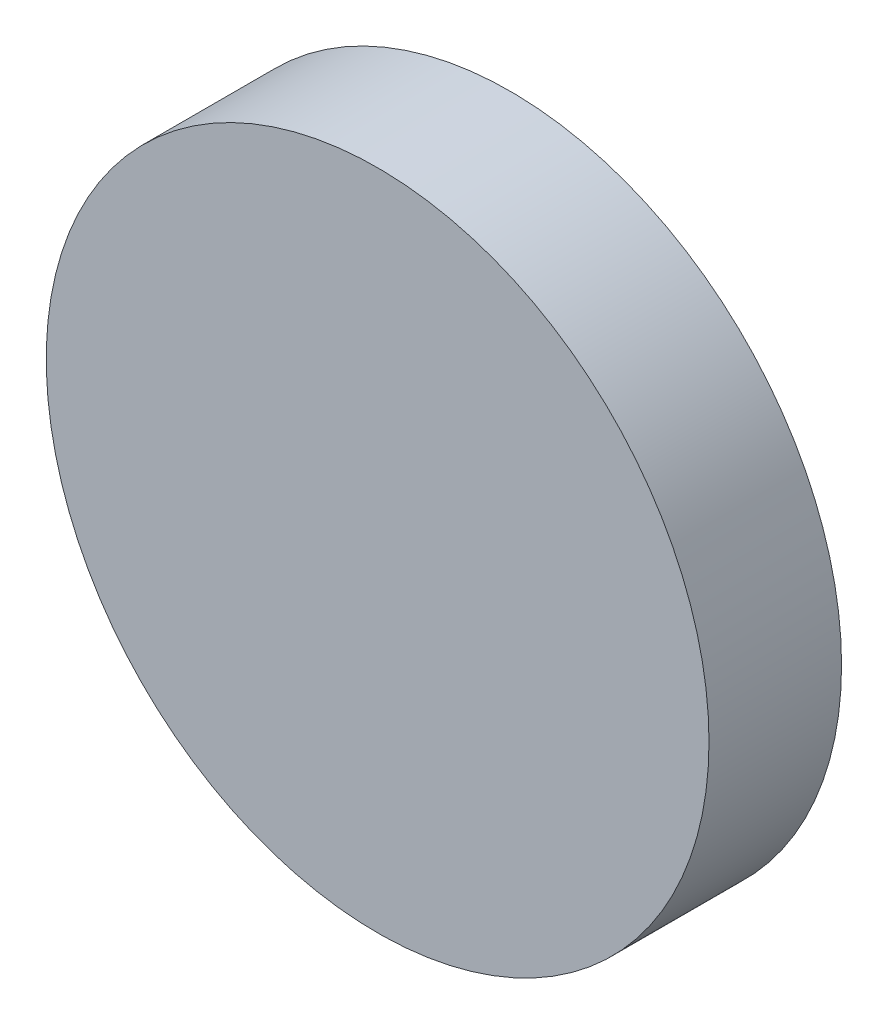
ISO-10303-21;
HEADER;
FILE_DESCRIPTION(('STEP AP214'),'2;1');
FILE_NAME('part.step','',(''),(''),'','','');
FILE_SCHEMA(('AUTOMOTIVE_DESIGN { 1 0 10303 214 1 1 1 1 }'));
ENDSEC;
DATA;
#1=APPLICATION_CONTEXT('core data for automotive mechanical design processes');
#2=APPLICATION_PROTOCOL_DEFINITION('international standard','automotive_design',2000,#1);
#3=PRODUCT_CONTEXT('',#1,'mechanical');
#4=PRODUCT('Part','Part','',(#3));
#5=PRODUCT_RELATED_PRODUCT_CATEGORY('part','',(#4));
#6=PRODUCT_DEFINITION_FORMATION('','',#4);
#7=PRODUCT_DEFINITION_CONTEXT('part definition',#1,'design');
#8=PRODUCT_DEFINITION('design','',#6,#7);
#9=PRODUCT_DEFINITION_SHAPE('','',#8);
#10=(LENGTH_UNIT() NAMED_UNIT(*) SI_UNIT(.MILLI.,.METRE.));
#11=(NAMED_UNIT(*) PLANE_ANGLE_UNIT() SI_UNIT($,.RADIAN.));
#12=(NAMED_UNIT(*) SI_UNIT($,.STERADIAN.) SOLID_ANGLE_UNIT());
#13=UNCERTAINTY_MEASURE_WITH_UNIT(LENGTH_MEASURE(1.E-05),#10,'distance_accuracy_value','');
#14=(GEOMETRIC_REPRESENTATION_CONTEXT(3) GLOBAL_UNCERTAINTY_ASSIGNED_CONTEXT((#13)) GLOBAL_UNIT_ASSIGNED_CONTEXT((#10,
#11,#12)) REPRESENTATION_CONTEXT('',''));
#15=CARTESIAN_POINT('',(0.,0.,0.));
#16=DIRECTION('',(0.,0.,1.));
#17=DIRECTION('',(1.,0.,0.));
#18=AXIS2_PLACEMENT_3D('',#15,#16,#17);
#19=CARTESIAN_POINT('',(0.,0.,100.));
#20=DIRECTION('',(0.,0.,-1.));
#21=DIRECTION('',(-1.,0.,0.));
#22=AXIS2_PLACEMENT_3D('',#19,#20,#21);
#23=CYLINDRICAL_SURFACE('',#22,250.);
#24=CARTESIAN_POINT('',(0.,0.,100.));
#25=DIRECTION('',(0.,0.,1.));
#26=DIRECTION('',(1.,0.,0.));
#27=AXIS2_PLACEMENT_3D('',#24,#25,#26);
#28=CIRCLE('',#27,250.);
#29=CARTESIAN_POINT('',(250.,0.,100.));
#30=VERTEX_POINT('',#29);
#31=EDGE_CURVE('E10',#30,#30,#28,.T.);
#32=ORIENTED_EDGE('',*,*,#31,.F.);
#33=EDGE_LOOP('',(#32));
#34=FACE_BOUND('',#33,.T.);
#35=CARTESIAN_POINT('',(0.,0.,0.));
#36=DIRECTION('',(0.,0.,1.));
#37=DIRECTION('',(1.,0.,0.));
#38=AXIS2_PLACEMENT_3D('',#35,#36,#37);
#39=CIRCLE('',#38,250.);
#40=CARTESIAN_POINT('',(250.,0.,0.));
#41=VERTEX_POINT('',#40);
#42=EDGE_CURVE('E44',#41,#41,#39,.T.);
#43=ORIENTED_EDGE('',*,*,#42,.T.);
#44=EDGE_LOOP('',(#43));
#45=FACE_BOUND('',#44,.T.);
#46=ADVANCED_FACE('F41',(#34,#45),#23,.T.);
#47=CARTESIAN_POINT('',(0.,0.,100.));
#48=DIRECTION('',(0.,0.,1.));
#49=DIRECTION('',(1.,0.,0.));
#50=AXIS2_PLACEMENT_3D('',#47,#48,#49);
#51=PLANE('',#50);
#52=ORIENTED_EDGE('',*,*,#31,.T.);
#53=EDGE_LOOP('',(#52));
#54=FACE_BOUND('',#53,.T.);
#55=ADVANCED_FACE('F58',(#54),#51,.T.);
#56=CARTESIAN_POINT('',(0.,0.,0.));
#57=DIRECTION('',(0.,0.,1.));
#58=DIRECTION('',(1.,0.,0.));
#59=AXIS2_PLACEMENT_3D('',#56,#57,#58);
#60=PLANE('',#59);
#61=ORIENTED_EDGE('',*,*,#42,.F.);
#62=EDGE_LOOP('',(#61));
#63=FACE_BOUND('',#62,.T.);
#64=ADVANCED_FACE('F56',(#63),#60,.F.);
#65=CLOSED_SHELL('',(#46,#55,#64));
#66=MANIFOLD_SOLID_BREP('B2',#65);
#67=ADVANCED_BREP_SHAPE_REPRESENTATION('',(#18,#66),#14);
#68=SHAPE_DEFINITION_REPRESENTATION(#9,#67);
ENDSEC;
END-ISO-10303-21;
